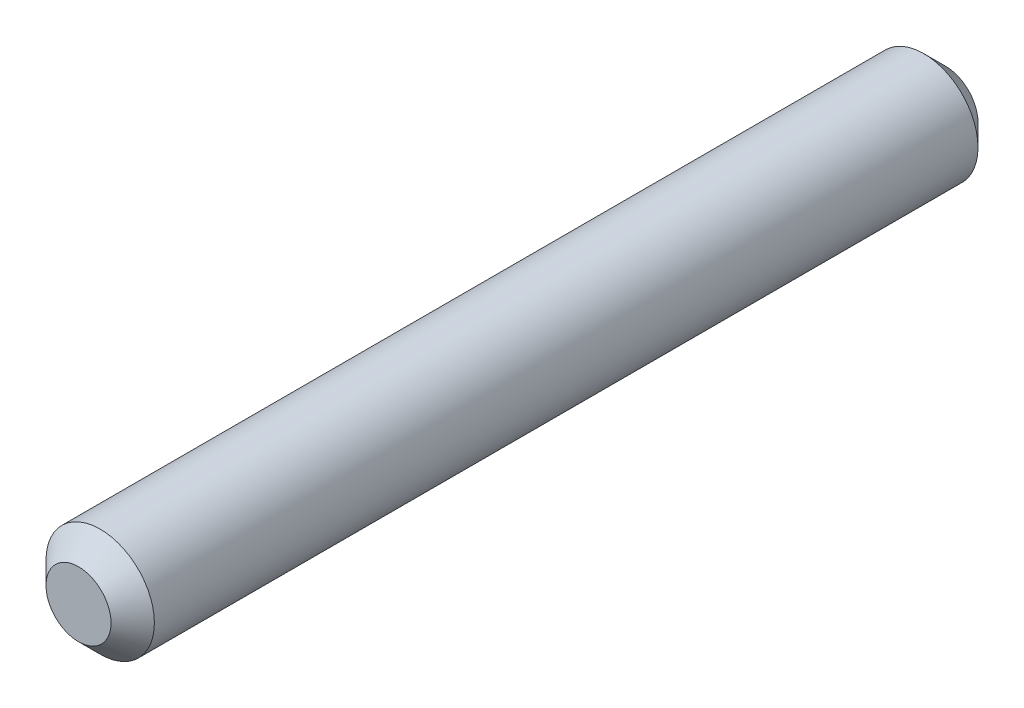
ISO-10303-21;
HEADER;
FILE_DESCRIPTION(('STEP AP214'),'2;1');
FILE_NAME('part.step','',(''),(''),'','','');
FILE_SCHEMA(('AUTOMOTIVE_DESIGN { 1 0 10303 214 1 1 1 1 }'));
ENDSEC;
DATA;
#1=APPLICATION_CONTEXT('core data for automotive mechanical design processes');
#2=APPLICATION_PROTOCOL_DEFINITION('international standard','automotive_design',2000,#1);
#3=PRODUCT_CONTEXT('',#1,'mechanical');
#4=PRODUCT('Part','Part','',(#3));
#5=PRODUCT_RELATED_PRODUCT_CATEGORY('part','',(#4));
#6=PRODUCT_DEFINITION_FORMATION('','',#4);
#7=PRODUCT_DEFINITION_CONTEXT('part definition',#1,'design');
#8=PRODUCT_DEFINITION('design','',#6,#7);
#9=PRODUCT_DEFINITION_SHAPE('','',#8);
#10=(LENGTH_UNIT() NAMED_UNIT(*) SI_UNIT(.MILLI.,.METRE.));
#11=(NAMED_UNIT(*) PLANE_ANGLE_UNIT() SI_UNIT($,.RADIAN.));
#12=(NAMED_UNIT(*) SI_UNIT($,.STERADIAN.) SOLID_ANGLE_UNIT());
#13=UNCERTAINTY_MEASURE_WITH_UNIT(LENGTH_MEASURE(1.E-05),#10,'distance_accuracy_value','');
#14=(GEOMETRIC_REPRESENTATION_CONTEXT(3) GLOBAL_UNCERTAINTY_ASSIGNED_CONTEXT((#13)) GLOBAL_UNIT_ASSIGNED_CONTEXT((#10,
#11,#12)) REPRESENTATION_CONTEXT('',''));
#15=CARTESIAN_POINT('',(0.,0.,0.));
#16=DIRECTION('',(0.,0.,1.));
#17=DIRECTION('',(1.,0.,0.));
#18=AXIS2_PLACEMENT_3D('',#15,#16,#17);
#19=CARTESIAN_POINT('',(0.,0.,40.));
#20=DIRECTION('',(0.,0.,-1.));
#21=DIRECTION('',(-1.,0.,0.));
#22=AXIS2_PLACEMENT_3D('',#19,#20,#21);
#23=CYLINDRICAL_SURFACE('',#22,2.5);
#24=CARTESIAN_POINT('',(0.,0.,1.));
#25=DIRECTION('',(0.,0.,1.));
#26=DIRECTION('',(1.,0.,0.));
#27=AXIS2_PLACEMENT_3D('',#24,#25,#26);
#28=CIRCLE('',#27,2.5);
#29=CARTESIAN_POINT('',(2.5,0.,1.));
#30=VERTEX_POINT('',#29);
#31=EDGE_CURVE('E39',#30,#30,#28,.T.);
#32=ORIENTED_EDGE('',*,*,#31,.T.);
#33=EDGE_LOOP('',(#32));
#34=FACE_BOUND('',#33,.T.);
#35=CARTESIAN_POINT('',(0.,0.,39.));
#36=DIRECTION('',(0.,0.,1.));
#37=DIRECTION('',(1.,0.,0.));
#38=AXIS2_PLACEMENT_3D('',#35,#36,#37);
#39=CIRCLE('',#38,2.5);
#40=CARTESIAN_POINT('',(2.5,0.,39.));
#41=VERTEX_POINT('',#40);
#42=EDGE_CURVE('E43',#41,#41,#39,.F.);
#43=ORIENTED_EDGE('',*,*,#42,.T.);
#44=EDGE_LOOP('',(#43));
#45=FACE_BOUND('',#44,.T.);
#46=ADVANCED_FACE('F32',(#34,#45),#23,.T.);
#47=CARTESIAN_POINT('',(0.,0.,40.));
#48=DIRECTION('',(0.,0.,1.));
#49=DIRECTION('',(1.,0.,0.));
#50=AXIS2_PLACEMENT_3D('',#47,#48,#49);
#51=PLANE('',#50);
#52=CARTESIAN_POINT('',(0.,0.,40.));
#53=DIRECTION('',(0.,0.,1.));
#54=DIRECTION('',(1.,0.,0.));
#55=AXIS2_PLACEMENT_3D('',#52,#53,#54);
#56=CIRCLE('',#55,1.49999999999999);
#57=CARTESIAN_POINT('',(1.49999999999999,0.,40.));
#58=VERTEX_POINT('',#57);
#59=EDGE_CURVE('E47',#58,#58,#56,.T.);
#60=ORIENTED_EDGE('',*,*,#59,.T.);
#61=EDGE_LOOP('',(#60));
#62=FACE_BOUND('',#61,.T.);
#63=ADVANCED_FACE('F53',(#62),#51,.T.);
#64=CARTESIAN_POINT('',(0.,0.,0.));
#65=DIRECTION('',(0.,0.,1.));
#66=DIRECTION('',(1.,0.,0.));
#67=AXIS2_PLACEMENT_3D('',#64,#65,#66);
#68=PLANE('',#67);
#69=CARTESIAN_POINT('',(0.,0.,0.));
#70=DIRECTION('',(0.,0.,1.));
#71=DIRECTION('',(1.,0.,0.));
#72=AXIS2_PLACEMENT_3D('',#69,#70,#71);
#73=CIRCLE('',#72,1.49999999999999);
#74=CARTESIAN_POINT('',(1.49999999999999,0.,0.));
#75=VERTEX_POINT('',#74);
#76=EDGE_CURVE('E10',#75,#75,#73,.F.);
#77=ORIENTED_EDGE('',*,*,#76,.T.);
#78=EDGE_LOOP('',(#77));
#79=FACE_BOUND('',#78,.T.);
#80=ADVANCED_FACE('F57',(#79),#68,.F.);
#81=CARTESIAN_POINT('',(0.,0.,40.));
#82=DIRECTION('',(0.,0.,-1.));
#83=DIRECTION('',(-1.,0.,0.));
#84=AXIS2_PLACEMENT_3D('',#81,#82,#83);
#85=CONICAL_SURFACE('',#84,1.49999999999999,0.785398163397445);
#86=ORIENTED_EDGE('',*,*,#42,.F.);
#87=EDGE_LOOP('',(#86));
#88=FACE_BOUND('',#87,.T.);
#89=ORIENTED_EDGE('',*,*,#59,.F.);
#90=EDGE_LOOP('',(#89));
#91=FACE_BOUND('',#90,.T.);
#92=ADVANCED_FACE('F55',(#88,#91),#85,.T.);
#93=CARTESIAN_POINT('',(0.,0.,1.));
#94=DIRECTION('',(0.,0.,1.));
#95=DIRECTION('',(1.,0.,0.));
#96=AXIS2_PLACEMENT_3D('',#93,#94,#95);
#97=CONICAL_SURFACE('',#96,2.5,0.78539816339745);
#98=ORIENTED_EDGE('',*,*,#76,.F.);
#99=EDGE_LOOP('',(#98));
#100=FACE_BOUND('',#99,.T.);
#101=ORIENTED_EDGE('',*,*,#31,.F.);
#102=EDGE_LOOP('',(#101));
#103=FACE_BOUND('',#102,.T.);
#104=ADVANCED_FACE('F34',(#100,#103),#97,.T.);
#105=CLOSED_SHELL('',(#46,#63,#80,#92,#104));
#106=MANIFOLD_SOLID_BREP('B2',#105);
#107=ADVANCED_BREP_SHAPE_REPRESENTATION('',(#18,#106),#14);
#108=SHAPE_DEFINITION_REPRESENTATION(#9,#107);
ENDSEC;
END-ISO-10303-21;
